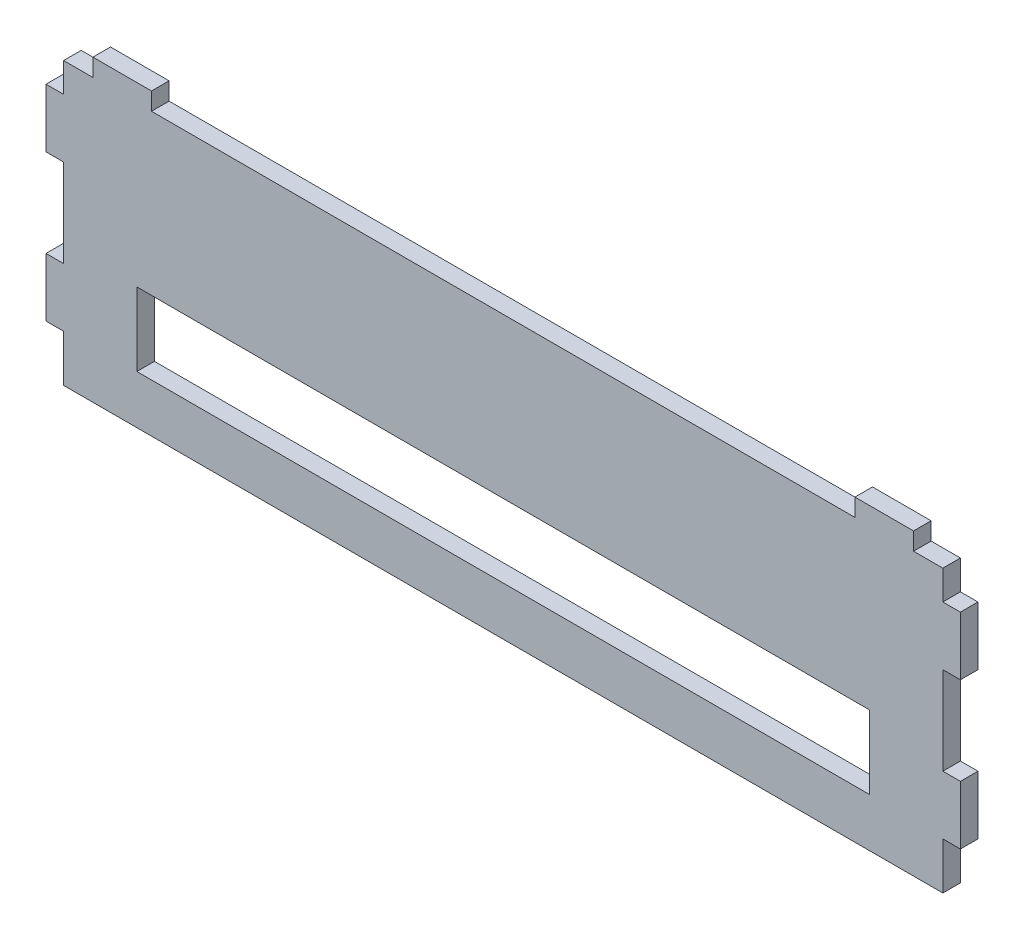
ISO-10303-21;
HEADER;
FILE_DESCRIPTION(('STEP AP214'),'2;1');
FILE_NAME('part.step','',(''),(''),'','','');
FILE_SCHEMA(('AUTOMOTIVE_DESIGN { 1 0 10303 214 1 1 1 1 }'));
ENDSEC;
DATA;
#1=APPLICATION_CONTEXT('core data for automotive mechanical design processes');
#2=APPLICATION_PROTOCOL_DEFINITION('international standard','automotive_design',2000,#1);
#3=PRODUCT_CONTEXT('',#1,'mechanical');
#4=PRODUCT('Part','Part','',(#3));
#5=PRODUCT_RELATED_PRODUCT_CATEGORY('part','',(#4));
#6=PRODUCT_DEFINITION_FORMATION('','',#4);
#7=PRODUCT_DEFINITION_CONTEXT('part definition',#1,'design');
#8=PRODUCT_DEFINITION('design','',#6,#7);
#9=PRODUCT_DEFINITION_SHAPE('','',#8);
#10=(LENGTH_UNIT() NAMED_UNIT(*) SI_UNIT(.MILLI.,.METRE.));
#11=(NAMED_UNIT(*) PLANE_ANGLE_UNIT() SI_UNIT($,.RADIAN.));
#12=(NAMED_UNIT(*) SI_UNIT($,.STERADIAN.) SOLID_ANGLE_UNIT());
#13=UNCERTAINTY_MEASURE_WITH_UNIT(LENGTH_MEASURE(1.E-05),#10,'distance_accuracy_value','');
#14=(GEOMETRIC_REPRESENTATION_CONTEXT(3) GLOBAL_UNCERTAINTY_ASSIGNED_CONTEXT((#13)) GLOBAL_UNIT_ASSIGNED_CONTEXT((#10,
#11,#12)) REPRESENTATION_CONTEXT('',''));
#15=CARTESIAN_POINT('',(0.,0.,0.));
#16=DIRECTION('',(0.,0.,1.));
#17=DIRECTION('',(1.,0.,0.));
#18=AXIS2_PLACEMENT_3D('',#15,#16,#17);
#19=CARTESIAN_POINT('',(495.568859933221,0.,-334.249904798704));
#20=DIRECTION('',(1.,0.,0.));
#21=DIRECTION('',(0.,1.,0.));
#22=AXIS2_PLACEMENT_3D('',#19,#20,#21);
#23=PLANE('',#22);
#24=DIRECTION('',(0.,0.,1.));
#25=VECTOR('',#24,1.);
#26=CARTESIAN_POINT('',(495.568859933221,-9.99999999999979,-334.249904798704));
#27=LINE('',#26,#25);
#28=CARTESIAN_POINT('',(495.568859933221,-9.99999999999979,-6.00000000000006));
#29=VERTEX_POINT('',#28);
#30=CARTESIAN_POINT('',(495.568859933221,-9.99999999999979,0.));
#31=VERTEX_POINT('',#30);
#32=EDGE_CURVE('E271',#29,#31,#27,.T.);
#33=ORIENTED_EDGE('',*,*,#32,.F.);
#34=DIRECTION('',(0.,1.,0.));
#35=VECTOR('',#34,1.);
#36=CARTESIAN_POINT('',(495.568859933221,1.13884563167231E-13,-6.00000000000006));
#37=LINE('',#36,#35);
#38=CARTESIAN_POINT('',(495.568859933221,0.,-6.00000000000006));
#39=VERTEX_POINT('',#38);
#40=EDGE_CURVE('E265',#29,#39,#37,.T.);
#41=ORIENTED_EDGE('',*,*,#40,.T.);
#42=DIRECTION('',(0.,0.,1.));
#43=VECTOR('',#42,1.);
#44=CARTESIAN_POINT('',(495.568859933221,0.,-334.249904798704));
#45=LINE('',#44,#43);
#46=CARTESIAN_POINT('',(495.568859933221,0.,0.));
#47=VERTEX_POINT('',#46);
#48=EDGE_CURVE('E267',#39,#47,#45,.T.);
#49=ORIENTED_EDGE('',*,*,#48,.T.);
#50=DIRECTION('',(0.,1.,0.));
#51=VECTOR('',#50,1.);
#52=CARTESIAN_POINT('',(495.568859933221,0.,0.));
#53=LINE('',#52,#51);
#54=EDGE_CURVE('E413',#31,#47,#53,.T.);
#55=ORIENTED_EDGE('',*,*,#54,.F.);
#56=EDGE_LOOP('',(#33,#41,#49,#55));
#57=FACE_BOUND('',#56,.T.);
#58=ADVANCED_FACE('F33',(#57),#23,.T.);
#59=CARTESIAN_POINT('',(501.568859933221,-9.99999999999979,-334.249904798704));
#60=DIRECTION('',(0.,1.,0.));
#61=DIRECTION('',(0.,0.,1.));
#62=AXIS2_PLACEMENT_3D('',#59,#60,#61);
#63=PLANE('',#62);
#64=DIRECTION('',(0.,0.,1.));
#65=VECTOR('',#64,1.);
#66=CARTESIAN_POINT('',(501.568859933221,-9.99999999999979,-334.249904798704));
#67=LINE('',#66,#65);
#68=CARTESIAN_POINT('',(501.568859933221,-9.99999999999979,-6.00000000000007));
#69=VERTEX_POINT('',#68);
#70=CARTESIAN_POINT('',(501.568859933221,-9.99999999999979,0.));
#71=VERTEX_POINT('',#70);
#72=EDGE_CURVE('E275',#69,#71,#67,.T.);
#73=ORIENTED_EDGE('',*,*,#72,.F.);
#74=DIRECTION('',(-1.,0.,0.));
#75=VECTOR('',#74,1.);
#76=CARTESIAN_POINT('',(501.568859933221,-9.99999999999979,-6.00000000000006));
#77=LINE('',#76,#75);
#78=EDGE_CURVE('E268',#69,#29,#77,.T.);
#79=ORIENTED_EDGE('',*,*,#78,.T.);
#80=ORIENTED_EDGE('',*,*,#32,.T.);
#81=DIRECTION('',(-1.,0.,0.));
#82=VECTOR('',#81,1.);
#83=CARTESIAN_POINT('',(501.568859933221,-9.99999999999979,0.));
#84=LINE('',#83,#82);
#85=EDGE_CURVE('E260',#71,#31,#84,.T.);
#86=ORIENTED_EDGE('',*,*,#85,.F.);
#87=EDGE_LOOP('',(#73,#79,#80,#86));
#88=FACE_BOUND('',#87,.T.);
#89=ADVANCED_FACE('F505',(#88),#63,.T.);
#90=CARTESIAN_POINT('',(501.568859933221,-29.9999999999998,-334.249904798704));
#91=DIRECTION('',(1.,0.,0.));
#92=DIRECTION('',(0.,0.,-1.));
#93=AXIS2_PLACEMENT_3D('',#90,#91,#92);
#94=PLANE('',#93);
#95=DIRECTION('',(0.,0.,1.));
#96=VECTOR('',#95,1.);
#97=CARTESIAN_POINT('',(501.568859933221,-29.9999999999998,-334.249904798704));
#98=LINE('',#97,#96);
#99=CARTESIAN_POINT('',(501.568859933221,-29.9999999999998,-6.00000000000006));
#100=VERTEX_POINT('',#99);
#101=CARTESIAN_POINT('',(501.568859933221,-29.9999999999998,0.));
#102=VERTEX_POINT('',#101);
#103=EDGE_CURVE('E279',#100,#102,#98,.T.);
#104=ORIENTED_EDGE('',*,*,#103,.F.);
#105=DIRECTION('',(0.,1.,0.));
#106=VECTOR('',#105,1.);
#107=CARTESIAN_POINT('',(501.568859933221,-29.9999999999997,-6.00000000000006));
#108=LINE('',#107,#106);
#109=EDGE_CURVE('E272',#100,#69,#108,.T.);
#110=ORIENTED_EDGE('',*,*,#109,.T.);
#111=ORIENTED_EDGE('',*,*,#72,.T.);
#112=DIRECTION('',(0.,1.,0.));
#113=VECTOR('',#112,1.);
#114=CARTESIAN_POINT('',(501.568859933221,-29.9999999999998,0.));
#115=LINE('',#114,#113);
#116=EDGE_CURVE('E497',#102,#71,#115,.T.);
#117=ORIENTED_EDGE('',*,*,#116,.F.);
#118=EDGE_LOOP('',(#104,#110,#111,#117));
#119=FACE_BOUND('',#118,.T.);
#120=ADVANCED_FACE('F609',(#119),#94,.T.);
#121=CARTESIAN_POINT('',(495.568859933221,-29.9999999999998,-334.249904798704));
#122=DIRECTION('',(0.,-1.,0.));
#123=DIRECTION('',(0.,0.,-1.));
#124=AXIS2_PLACEMENT_3D('',#121,#122,#123);
#125=PLANE('',#124);
#126=DIRECTION('',(0.,0.,1.));
#127=VECTOR('',#126,1.);
#128=CARTESIAN_POINT('',(495.568859933221,-29.9999999999998,-334.249904798704));
#129=LINE('',#128,#127);
#130=CARTESIAN_POINT('',(495.568859933221,-29.9999999999998,-6.00000000000006));
#131=VERTEX_POINT('',#130);
#132=CARTESIAN_POINT('',(495.568859933221,-29.9999999999998,0.));
#133=VERTEX_POINT('',#132);
#134=EDGE_CURVE('E283',#131,#133,#129,.T.);
#135=ORIENTED_EDGE('',*,*,#134,.F.);
#136=DIRECTION('',(1.,0.,0.));
#137=VECTOR('',#136,1.);
#138=CARTESIAN_POINT('',(495.568859933221,-29.9999999999998,-6.00000000000006));
#139=LINE('',#138,#137);
#140=EDGE_CURVE('E276',#131,#100,#139,.T.);
#141=ORIENTED_EDGE('',*,*,#140,.T.);
#142=ORIENTED_EDGE('',*,*,#103,.T.);
#143=DIRECTION('',(1.,0.,0.));
#144=VECTOR('',#143,1.);
#145=CARTESIAN_POINT('',(495.568859933221,-29.9999999999998,0.));
#146=LINE('',#145,#144);
#147=EDGE_CURVE('E494',#133,#102,#146,.T.);
#148=ORIENTED_EDGE('',*,*,#147,.F.);
#149=EDGE_LOOP('',(#135,#141,#142,#148));
#150=FACE_BOUND('',#149,.T.);
#151=ADVANCED_FACE('F606',(#150),#125,.T.);
#152=CARTESIAN_POINT('',(495.568859933221,-29.9999999999998,-334.249904798704));
#153=DIRECTION('',(1.,0.,0.));
#154=DIRECTION('',(0.,0.,-1.));
#155=AXIS2_PLACEMENT_3D('',#152,#153,#154);
#156=PLANE('',#155);
#157=DIRECTION('',(0.,0.,1.));
#158=VECTOR('',#157,1.);
#159=CARTESIAN_POINT('',(495.568859933221,-59.9999999999996,-334.249904798704));
#160=LINE('',#159,#158);
#161=CARTESIAN_POINT('',(495.568859933221,-59.9999999999996,-6.00000000000006));
#162=VERTEX_POINT('',#161);
#163=CARTESIAN_POINT('',(495.568859933221,-59.9999999999996,0.));
#164=VERTEX_POINT('',#163);
#165=EDGE_CURVE('E287',#162,#164,#160,.T.);
#166=ORIENTED_EDGE('',*,*,#165,.F.);
#167=DIRECTION('',(0.,1.,0.));
#168=VECTOR('',#167,1.);
#169=CARTESIAN_POINT('',(495.568859933221,-29.9999999999997,-6.00000000000006));
#170=LINE('',#169,#168);
#171=EDGE_CURVE('E280',#162,#131,#170,.T.);
#172=ORIENTED_EDGE('',*,*,#171,.T.);
#173=ORIENTED_EDGE('',*,*,#134,.T.);
#174=DIRECTION('',(0.,1.,0.));
#175=VECTOR('',#174,1.);
#176=CARTESIAN_POINT('',(495.568859933221,-29.9999999999998,0.));
#177=LINE('',#176,#175);
#178=EDGE_CURVE('E491',#164,#133,#177,.T.);
#179=ORIENTED_EDGE('',*,*,#178,.F.);
#180=EDGE_LOOP('',(#166,#172,#173,#179));
#181=FACE_BOUND('',#180,.T.);
#182=ADVANCED_FACE('F603',(#181),#156,.T.);
#183=CARTESIAN_POINT('',(501.568859933221,-59.9999999999996,-334.249904798704));
#184=DIRECTION('',(0.,1.,0.));
#185=DIRECTION('',(0.,0.,1.));
#186=AXIS2_PLACEMENT_3D('',#183,#184,#185);
#187=PLANE('',#186);
#188=DIRECTION('',(0.,0.,1.));
#189=VECTOR('',#188,1.);
#190=CARTESIAN_POINT('',(501.568859933221,-59.9999999999996,-334.249904798704));
#191=LINE('',#190,#189);
#192=CARTESIAN_POINT('',(501.568859933221,-59.9999999999996,-6.00000000000007));
#193=VERTEX_POINT('',#192);
#194=CARTESIAN_POINT('',(501.568859933221,-59.9999999999996,0.));
#195=VERTEX_POINT('',#194);
#196=EDGE_CURVE('E291',#193,#195,#191,.T.);
#197=ORIENTED_EDGE('',*,*,#196,.F.);
#198=DIRECTION('',(-1.,0.,0.));
#199=VECTOR('',#198,1.);
#200=CARTESIAN_POINT('',(501.568859933221,-59.9999999999996,-6.00000000000006));
#201=LINE('',#200,#199);
#202=EDGE_CURVE('E284',#193,#162,#201,.T.);
#203=ORIENTED_EDGE('',*,*,#202,.T.);
#204=ORIENTED_EDGE('',*,*,#165,.T.);
#205=DIRECTION('',(-1.,0.,0.));
#206=VECTOR('',#205,1.);
#207=CARTESIAN_POINT('',(501.568859933221,-59.9999999999996,0.));
#208=LINE('',#207,#206);
#209=EDGE_CURVE('E488',#195,#164,#208,.T.);
#210=ORIENTED_EDGE('',*,*,#209,.F.);
#211=EDGE_LOOP('',(#197,#203,#204,#210));
#212=FACE_BOUND('',#211,.T.);
#213=ADVANCED_FACE('F598',(#212),#187,.T.);
#214=CARTESIAN_POINT('',(501.568859933221,-79.9999999999996,-334.249904798704));
#215=DIRECTION('',(1.,0.,0.));
#216=DIRECTION('',(0.,0.,-1.));
#217=AXIS2_PLACEMENT_3D('',#214,#215,#216);
#218=PLANE('',#217);
#219=DIRECTION('',(0.,0.,1.));
#220=VECTOR('',#219,1.);
#221=CARTESIAN_POINT('',(501.568859933221,-79.9999999999996,-334.249904798704));
#222=LINE('',#221,#220);
#223=CARTESIAN_POINT('',(501.568859933221,-79.9999999999996,-6.00000000000006));
#224=VERTEX_POINT('',#223);
#225=CARTESIAN_POINT('',(501.568859933221,-79.9999999999996,0.));
#226=VERTEX_POINT('',#225);
#227=EDGE_CURVE('E295',#224,#226,#222,.T.);
#228=ORIENTED_EDGE('',*,*,#227,.F.);
#229=DIRECTION('',(0.,1.,0.));
#230=VECTOR('',#229,1.);
#231=CARTESIAN_POINT('',(501.568859933221,-79.9999999999995,-6.00000000000006));
#232=LINE('',#231,#230);
#233=EDGE_CURVE('E288',#224,#193,#232,.T.);
#234=ORIENTED_EDGE('',*,*,#233,.T.);
#235=ORIENTED_EDGE('',*,*,#196,.T.);
#236=DIRECTION('',(0.,1.,0.));
#237=VECTOR('',#236,1.);
#238=CARTESIAN_POINT('',(501.568859933221,-79.9999999999996,0.));
#239=LINE('',#238,#237);
#240=EDGE_CURVE('E485',#226,#195,#239,.T.);
#241=ORIENTED_EDGE('',*,*,#240,.F.);
#242=EDGE_LOOP('',(#228,#234,#235,#241));
#243=FACE_BOUND('',#242,.T.);
#244=ADVANCED_FACE('F594',(#243),#218,.T.);
#245=CARTESIAN_POINT('',(495.568859933221,-79.9999999999996,-334.249904798704));
#246=DIRECTION('',(0.,-1.,0.));
#247=DIRECTION('',(0.,0.,-1.));
#248=AXIS2_PLACEMENT_3D('',#245,#246,#247);
#249=PLANE('',#248);
#250=DIRECTION('',(0.,0.,1.));
#251=VECTOR('',#250,1.);
#252=CARTESIAN_POINT('',(495.568859933221,-79.9999999999996,-334.249904798704));
#253=LINE('',#252,#251);
#254=CARTESIAN_POINT('',(495.568859933221,-79.9999999999996,-6.00000000000006));
#255=VERTEX_POINT('',#254);
#256=CARTESIAN_POINT('',(495.568859933221,-79.9999999999996,0.));
#257=VERTEX_POINT('',#256);
#258=EDGE_CURVE('E299',#255,#257,#253,.T.);
#259=ORIENTED_EDGE('',*,*,#258,.F.);
#260=DIRECTION('',(1.,0.,0.));
#261=VECTOR('',#260,1.);
#262=CARTESIAN_POINT('',(495.568859933221,-79.9999999999996,-6.00000000000006));
#263=LINE('',#262,#261);
#264=EDGE_CURVE('E292',#255,#224,#263,.T.);
#265=ORIENTED_EDGE('',*,*,#264,.T.);
#266=ORIENTED_EDGE('',*,*,#227,.T.);
#267=DIRECTION('',(1.,0.,0.));
#268=VECTOR('',#267,1.);
#269=CARTESIAN_POINT('',(495.568859933221,-79.9999999999996,0.));
#270=LINE('',#269,#268);
#271=EDGE_CURVE('E482',#257,#226,#270,.T.);
#272=ORIENTED_EDGE('',*,*,#271,.F.);
#273=EDGE_LOOP('',(#259,#265,#266,#272));
#274=FACE_BOUND('',#273,.T.);
#275=ADVANCED_FACE('F591',(#274),#249,.T.);
#276=CARTESIAN_POINT('',(495.568859933221,-79.9999999999996,-334.249904798704));
#277=DIRECTION('',(1.,0.,0.));
#278=DIRECTION('',(0.,1.,0.));
#279=AXIS2_PLACEMENT_3D('',#276,#277,#278);
#280=PLANE('',#279);
#281=DIRECTION('',(0.,0.,1.));
#282=VECTOR('',#281,1.);
#283=CARTESIAN_POINT('',(495.568859933221,-96.0000000014325,-334.249904798704));
#284=LINE('',#283,#282);
#285=CARTESIAN_POINT('',(495.568859933221,-96.0000000014325,-6.00000000000006));
#286=VERTEX_POINT('',#285);
#287=CARTESIAN_POINT('',(495.568859933221,-96.0000000014325,0.));
#288=VERTEX_POINT('',#287);
#289=EDGE_CURVE('E303',#286,#288,#284,.T.);
#290=ORIENTED_EDGE('',*,*,#289,.F.);
#291=DIRECTION('',(0.,1.,0.));
#292=VECTOR('',#291,1.);
#293=CARTESIAN_POINT('',(495.568859933221,-79.9999999999995,-6.00000000000006));
#294=LINE('',#293,#292);
#295=EDGE_CURVE('E296',#286,#255,#294,.T.);
#296=ORIENTED_EDGE('',*,*,#295,.T.);
#297=ORIENTED_EDGE('',*,*,#258,.T.);
#298=DIRECTION('',(0.,1.,0.));
#299=VECTOR('',#298,1.);
#300=CARTESIAN_POINT('',(495.568859933221,-79.9999999999996,0.));
#301=LINE('',#300,#299);
#302=EDGE_CURVE('E479',#288,#257,#301,.T.);
#303=ORIENTED_EDGE('',*,*,#302,.F.);
#304=EDGE_LOOP('',(#290,#296,#297,#303));
#305=FACE_BOUND('',#304,.T.);
#306=ADVANCED_FACE('F586',(#305),#280,.T.);
#307=CARTESIAN_POINT('',(495.568859933221,-96.0000000014325,-334.249904798704));
#308=DIRECTION('',(0.,-1.,0.));
#309=DIRECTION('',(0.,0.,-1.));
#310=AXIS2_PLACEMENT_3D('',#307,#308,#309);
#311=PLANE('',#310);
#312=DIRECTION('',(0.,0.,1.));
#313=VECTOR('',#312,1.);
#314=CARTESIAN_POINT('',(195.568859933244,-96.0000000014325,-334.249904798704));
#315=LINE('',#314,#313);
#316=CARTESIAN_POINT('',(195.568859933244,-96.0000000014325,-6.00000000000011));
#317=VERTEX_POINT('',#316);
#318=CARTESIAN_POINT('',(195.568859933244,-96.0000000014325,0.));
#319=VERTEX_POINT('',#318);
#320=EDGE_CURVE('E307',#317,#319,#315,.T.);
#321=ORIENTED_EDGE('',*,*,#320,.F.);
#322=DIRECTION('',(1.,0.,0.));
#323=VECTOR('',#322,1.);
#324=CARTESIAN_POINT('',(495.568859933221,-96.0000000014325,-6.00000000000006));
#325=LINE('',#324,#323);
#326=EDGE_CURVE('E300',#317,#286,#325,.T.);
#327=ORIENTED_EDGE('',*,*,#326,.T.);
#328=ORIENTED_EDGE('',*,*,#289,.T.);
#329=DIRECTION('',(1.,0.,0.));
#330=VECTOR('',#329,1.);
#331=CARTESIAN_POINT('',(495.568859933221,-96.0000000014325,0.));
#332=LINE('',#331,#330);
#333=EDGE_CURVE('E476',#319,#288,#332,.T.);
#334=ORIENTED_EDGE('',*,*,#333,.F.);
#335=EDGE_LOOP('',(#321,#327,#328,#334));
#336=FACE_BOUND('',#335,.T.);
#337=ADVANCED_FACE('F582',(#336),#311,.T.);
#338=CARTESIAN_POINT('',(195.568859933245,-80.0000000014323,-334.249904798704));
#339=DIRECTION('',(-1.,0.,0.));
#340=DIRECTION('',(0.,-1.,0.));
#341=AXIS2_PLACEMENT_3D('',#338,#339,#340);
#342=PLANE('',#341);
#343=DIRECTION('',(0.,0.,1.));
#344=VECTOR('',#343,1.);
#345=CARTESIAN_POINT('',(195.568859933245,-80.0000000014323,-334.249904798704));
#346=LINE('',#345,#344);
#347=CARTESIAN_POINT('',(195.568859933245,-80.0000000014323,-6.00000000000011));
#348=VERTEX_POINT('',#347);
#349=CARTESIAN_POINT('',(195.568859933245,-80.0000000014323,0.));
#350=VERTEX_POINT('',#349);
#351=EDGE_CURVE('E311',#348,#350,#346,.T.);
#352=ORIENTED_EDGE('',*,*,#351,.F.);
#353=DIRECTION('',(0.,-1.,0.));
#354=VECTOR('',#353,1.);
#355=CARTESIAN_POINT('',(195.568859933245,-80.0000000014321,-6.00000000000012));
#356=LINE('',#355,#354);
#357=EDGE_CURVE('E304',#348,#317,#356,.T.);
#358=ORIENTED_EDGE('',*,*,#357,.T.);
#359=ORIENTED_EDGE('',*,*,#320,.T.);
#360=DIRECTION('',(0.,-1.,0.));
#361=VECTOR('',#360,1.);
#362=CARTESIAN_POINT('',(195.568859933245,-80.0000000014323,0.));
#363=LINE('',#362,#361);
#364=EDGE_CURVE('E473',#350,#319,#363,.T.);
#365=ORIENTED_EDGE('',*,*,#364,.F.);
#366=EDGE_LOOP('',(#352,#358,#359,#365));
#367=FACE_BOUND('',#366,.T.);
#368=ADVANCED_FACE('F579',(#367),#342,.T.);
#369=CARTESIAN_POINT('',(189.568859933245,-80.0000000014323,-334.249904798704));
#370=DIRECTION('',(0.,-1.,0.));
#371=DIRECTION('',(0.,0.,-1.));
#372=AXIS2_PLACEMENT_3D('',#369,#370,#371);
#373=PLANE('',#372);
#374=DIRECTION('',(0.,0.,1.));
#375=VECTOR('',#374,1.);
#376=CARTESIAN_POINT('',(189.568859933245,-80.0000000014323,-334.249904798704));
#377=LINE('',#376,#375);
#378=CARTESIAN_POINT('',(189.568859933245,-80.0000000014323,-6.00000000000017));
#379=VERTEX_POINT('',#378);
#380=CARTESIAN_POINT('',(189.568859933245,-80.0000000014323,0.));
#381=VERTEX_POINT('',#380);
#382=EDGE_CURVE('E315',#379,#381,#377,.T.);
#383=ORIENTED_EDGE('',*,*,#382,.F.);
#384=DIRECTION('',(1.,0.,0.));
#385=VECTOR('',#384,1.);
#386=CARTESIAN_POINT('',(189.568859933245,-80.0000000014323,-6.00000000000012));
#387=LINE('',#386,#385);
#388=EDGE_CURVE('E308',#379,#348,#387,.T.);
#389=ORIENTED_EDGE('',*,*,#388,.T.);
#390=ORIENTED_EDGE('',*,*,#351,.T.);
#391=DIRECTION('',(1.,0.,0.));
#392=VECTOR('',#391,1.);
#393=CARTESIAN_POINT('',(189.568859933245,-80.0000000014323,0.));
#394=LINE('',#393,#392);
#395=EDGE_CURVE('E470',#381,#350,#394,.T.);
#396=ORIENTED_EDGE('',*,*,#395,.F.);
#397=EDGE_LOOP('',(#383,#389,#390,#396));
#398=FACE_BOUND('',#397,.T.);
#399=ADVANCED_FACE('F574',(#398),#373,.T.);
#400=CARTESIAN_POINT('',(189.568859933245,-60.0000000014322,-334.249904798704));
#401=DIRECTION('',(-1.,0.,0.));
#402=DIRECTION('',(0.,0.,1.));
#403=AXIS2_PLACEMENT_3D('',#400,#401,#402);
#404=PLANE('',#403);
#405=DIRECTION('',(0.,0.,1.));
#406=VECTOR('',#405,1.);
#407=CARTESIAN_POINT('',(189.568859933245,-60.0000000014322,-334.249904798704));
#408=LINE('',#407,#406);
#409=CARTESIAN_POINT('',(189.568859933245,-60.0000000014322,-6.00000000000017));
#410=VERTEX_POINT('',#409);
#411=CARTESIAN_POINT('',(189.568859933245,-60.0000000014322,0.));
#412=VERTEX_POINT('',#411);
#413=EDGE_CURVE('E319',#410,#412,#408,.T.);
#414=ORIENTED_EDGE('',*,*,#413,.F.);
#415=DIRECTION('',(0.,-1.,0.));
#416=VECTOR('',#415,1.);
#417=CARTESIAN_POINT('',(189.568859933245,-60.0000000014321,-6.00000000000017));
#418=LINE('',#417,#416);
#419=EDGE_CURVE('E312',#410,#379,#418,.T.);
#420=ORIENTED_EDGE('',*,*,#419,.T.);
#421=ORIENTED_EDGE('',*,*,#382,.T.);
#422=DIRECTION('',(0.,-1.,0.));
#423=VECTOR('',#422,1.);
#424=CARTESIAN_POINT('',(189.568859933245,-60.0000000014322,0.));
#425=LINE('',#424,#423);
#426=EDGE_CURVE('E467',#412,#381,#425,.T.);
#427=ORIENTED_EDGE('',*,*,#426,.F.);
#428=EDGE_LOOP('',(#414,#420,#421,#427));
#429=FACE_BOUND('',#428,.T.);
#430=ADVANCED_FACE('F570',(#429),#404,.T.);
#431=CARTESIAN_POINT('',(195.568859933245,-60.0000000014322,-334.249904798704));
#432=DIRECTION('',(0.,1.,0.));
#433=DIRECTION('',(0.,0.,1.));
#434=AXIS2_PLACEMENT_3D('',#431,#432,#433);
#435=PLANE('',#434);
#436=DIRECTION('',(0.,0.,1.));
#437=VECTOR('',#436,1.);
#438=CARTESIAN_POINT('',(195.568859933245,-60.0000000014322,-334.249904798704));
#439=LINE('',#438,#437);
#440=CARTESIAN_POINT('',(195.568859933245,-60.0000000014322,-6.00000000000016));
#441=VERTEX_POINT('',#440);
#442=CARTESIAN_POINT('',(195.568859933245,-60.0000000014322,0.));
#443=VERTEX_POINT('',#442);
#444=EDGE_CURVE('E323',#441,#443,#439,.T.);
#445=ORIENTED_EDGE('',*,*,#444,.F.);
#446=DIRECTION('',(-1.,0.,0.));
#447=VECTOR('',#446,1.);
#448=CARTESIAN_POINT('',(195.568859933245,-60.0000000014322,-6.00000000000017));
#449=LINE('',#448,#447);
#450=EDGE_CURVE('E316',#441,#410,#449,.T.);
#451=ORIENTED_EDGE('',*,*,#450,.T.);
#452=ORIENTED_EDGE('',*,*,#413,.T.);
#453=DIRECTION('',(-1.,0.,0.));
#454=VECTOR('',#453,1.);
#455=CARTESIAN_POINT('',(195.568859933245,-60.0000000014322,0.));
#456=LINE('',#455,#454);
#457=EDGE_CURVE('E464',#443,#412,#456,.T.);
#458=ORIENTED_EDGE('',*,*,#457,.F.);
#459=EDGE_LOOP('',(#445,#451,#452,#458));
#460=FACE_BOUND('',#459,.T.);
#461=ADVANCED_FACE('F567',(#460),#435,.T.);
#462=CARTESIAN_POINT('',(195.568859933245,-30.0000000014324,-334.249904798704));
#463=DIRECTION('',(-1.,0.,0.));
#464=DIRECTION('',(0.,0.,1.));
#465=AXIS2_PLACEMENT_3D('',#462,#463,#464);
#466=PLANE('',#465);
#467=DIRECTION('',(0.,0.,1.));
#468=VECTOR('',#467,1.);
#469=CARTESIAN_POINT('',(195.568859933245,-30.0000000014324,-334.249904798704));
#470=LINE('',#469,#468);
#471=CARTESIAN_POINT('',(195.568859933245,-30.0000000014324,-6.00000000000017));
#472=VERTEX_POINT('',#471);
#473=CARTESIAN_POINT('',(195.568859933245,-30.0000000014324,0.));
#474=VERTEX_POINT('',#473);
#475=EDGE_CURVE('E327',#472,#474,#470,.T.);
#476=ORIENTED_EDGE('',*,*,#475,.F.);
#477=DIRECTION('',(0.,-1.,0.));
#478=VECTOR('',#477,1.);
#479=CARTESIAN_POINT('',(195.568859933245,-30.0000000014323,-6.00000000000017));
#480=LINE('',#479,#478);
#481=EDGE_CURVE('E320',#472,#441,#480,.T.);
#482=ORIENTED_EDGE('',*,*,#481,.T.);
#483=ORIENTED_EDGE('',*,*,#444,.T.);
#484=DIRECTION('',(0.,-1.,0.));
#485=VECTOR('',#484,1.);
#486=CARTESIAN_POINT('',(195.568859933245,-30.0000000014324,0.));
#487=LINE('',#486,#485);
#488=EDGE_CURVE('E461',#474,#443,#487,.T.);
#489=ORIENTED_EDGE('',*,*,#488,.F.);
#490=EDGE_LOOP('',(#476,#482,#483,#489));
#491=FACE_BOUND('',#490,.T.);
#492=ADVANCED_FACE('F562',(#491),#466,.T.);
#493=CARTESIAN_POINT('',(189.568859933245,-30.0000000014324,-334.249904798704));
#494=DIRECTION('',(0.,-1.,0.));
#495=DIRECTION('',(0.,0.,-1.));
#496=AXIS2_PLACEMENT_3D('',#493,#494,#495);
#497=PLANE('',#496);
#498=DIRECTION('',(0.,0.,1.));
#499=VECTOR('',#498,1.);
#500=CARTESIAN_POINT('',(189.568859933245,-30.0000000014324,-334.249904798704));
#501=LINE('',#500,#499);
#502=CARTESIAN_POINT('',(189.568859933245,-30.0000000014324,-6.00000000000017));
#503=VERTEX_POINT('',#502);
#504=CARTESIAN_POINT('',(189.568859933245,-30.0000000014324,0.));
#505=VERTEX_POINT('',#504);
#506=EDGE_CURVE('E331',#503,#505,#501,.T.);
#507=ORIENTED_EDGE('',*,*,#506,.F.);
#508=DIRECTION('',(1.,0.,0.));
#509=VECTOR('',#508,1.);
#510=CARTESIAN_POINT('',(189.568859933245,-30.0000000014324,-6.00000000000017));
#511=LINE('',#510,#509);
#512=EDGE_CURVE('E324',#503,#472,#511,.T.);
#513=ORIENTED_EDGE('',*,*,#512,.T.);
#514=ORIENTED_EDGE('',*,*,#475,.T.);
#515=DIRECTION('',(1.,0.,0.));
#516=VECTOR('',#515,1.);
#517=CARTESIAN_POINT('',(189.568859933245,-30.0000000014324,0.));
#518=LINE('',#517,#516);
#519=EDGE_CURVE('E458',#505,#474,#518,.T.);
#520=ORIENTED_EDGE('',*,*,#519,.F.);
#521=EDGE_LOOP('',(#507,#513,#514,#520));
#522=FACE_BOUND('',#521,.T.);
#523=ADVANCED_FACE('F558',(#522),#497,.T.);
#524=CARTESIAN_POINT('',(189.568859933245,-10.0000000014324,-334.249904798704));
#525=DIRECTION('',(-1.,0.,0.));
#526=DIRECTION('',(0.,-1.,0.));
#527=AXIS2_PLACEMENT_3D('',#524,#525,#526);
#528=PLANE('',#527);
#529=DIRECTION('',(0.,0.,1.));
#530=VECTOR('',#529,1.);
#531=CARTESIAN_POINT('',(189.568859933245,-10.0000000014324,-334.249904798704));
#532=LINE('',#531,#530);
#533=CARTESIAN_POINT('',(189.568859933245,-10.0000000014324,-6.00000000000017));
#534=VERTEX_POINT('',#533);
#535=CARTESIAN_POINT('',(189.568859933245,-10.0000000014324,0.));
#536=VERTEX_POINT('',#535);
#537=EDGE_CURVE('E335',#534,#536,#532,.T.);
#538=ORIENTED_EDGE('',*,*,#537,.F.);
#539=DIRECTION('',(0.,-1.,0.));
#540=VECTOR('',#539,1.);
#541=CARTESIAN_POINT('',(189.568859933245,-10.0000000014323,-6.00000000000017));
#542=LINE('',#541,#540);
#543=EDGE_CURVE('E328',#534,#503,#542,.T.);
#544=ORIENTED_EDGE('',*,*,#543,.T.);
#545=ORIENTED_EDGE('',*,*,#506,.T.);
#546=DIRECTION('',(0.,-1.,0.));
#547=VECTOR('',#546,1.);
#548=CARTESIAN_POINT('',(189.568859933245,-10.0000000014324,0.));
#549=LINE('',#548,#547);
#550=EDGE_CURVE('E455',#536,#505,#549,.T.);
#551=ORIENTED_EDGE('',*,*,#550,.F.);
#552=EDGE_LOOP('',(#538,#544,#545,#551));
#553=FACE_BOUND('',#552,.T.);
#554=ADVANCED_FACE('F555',(#553),#528,.T.);
#555=CARTESIAN_POINT('',(195.568859933245,-10.0000000014324,-334.249904798704));
#556=DIRECTION('',(0.,1.,0.));
#557=DIRECTION('',(0.,0.,1.));
#558=AXIS2_PLACEMENT_3D('',#555,#556,#557);
#559=PLANE('',#558);
#560=DIRECTION('',(0.,0.,1.));
#561=VECTOR('',#560,1.);
#562=CARTESIAN_POINT('',(195.568859933245,-10.0000000014324,-334.249904798704));
#563=LINE('',#562,#561);
#564=CARTESIAN_POINT('',(195.568859933245,-10.0000000014324,-6.00000000000017));
#565=VERTEX_POINT('',#564);
#566=CARTESIAN_POINT('',(195.568859933245,-10.0000000014324,0.));
#567=VERTEX_POINT('',#566);
#568=EDGE_CURVE('E339',#565,#567,#563,.T.);
#569=ORIENTED_EDGE('',*,*,#568,.F.);
#570=DIRECTION('',(-1.,0.,0.));
#571=VECTOR('',#570,1.);
#572=CARTESIAN_POINT('',(195.568859933245,-10.0000000014324,-6.00000000000017));
#573=LINE('',#572,#571);
#574=EDGE_CURVE('E332',#565,#534,#573,.T.);
#575=ORIENTED_EDGE('',*,*,#574,.T.);
#576=ORIENTED_EDGE('',*,*,#537,.T.);
#577=DIRECTION('',(-1.,0.,0.));
#578=VECTOR('',#577,1.);
#579=CARTESIAN_POINT('',(195.568859933245,-10.0000000014324,0.));
#580=LINE('',#579,#578);
#581=EDGE_CURVE('E452',#567,#536,#580,.T.);
#582=ORIENTED_EDGE('',*,*,#581,.F.);
#583=EDGE_LOOP('',(#569,#575,#576,#582));
#584=FACE_BOUND('',#583,.T.);
#585=ADVANCED_FACE('F550',(#584),#559,.T.);
#586=CARTESIAN_POINT('',(195.568859933246,0.,-334.249904798704));
#587=DIRECTION('',(-1.,1.3045120537477E-13,0.));
#588=DIRECTION('',(-1.3045120537477E-13,-1.,0.));
#589=AXIS2_PLACEMENT_3D('',#586,#587,#588);
#590=PLANE('',#589);
#591=DIRECTION('',(0.,0.,1.));
#592=VECTOR('',#591,1.);
#593=CARTESIAN_POINT('',(195.568859933246,0.,-334.249904798704));
#594=LINE('',#593,#592);
#595=CARTESIAN_POINT('',(195.568859933246,0.,-6.00000000000017));
#596=VERTEX_POINT('',#595);
#597=CARTESIAN_POINT('',(195.568859933246,0.,0.));
#598=VERTEX_POINT('',#597);
#599=EDGE_CURVE('E343',#596,#598,#594,.T.);
#600=ORIENTED_EDGE('',*,*,#599,.F.);
#601=DIRECTION('',(-1.3045120537477E-13,-1.,0.));
#602=VECTOR('',#601,1.);
#603=CARTESIAN_POINT('',(195.568859933246,1.13884563167218E-13,-6.00000000000017));
#604=LINE('',#603,#602);
#605=EDGE_CURVE('E336',#596,#565,#604,.T.);
#606=ORIENTED_EDGE('',*,*,#605,.T.);
#607=ORIENTED_EDGE('',*,*,#568,.T.);
#608=DIRECTION('',(-1.3045120537477E-13,-1.,0.));
#609=VECTOR('',#608,1.);
#610=CARTESIAN_POINT('',(195.568859933246,0.,0.));
#611=LINE('',#610,#609);
#612=EDGE_CURVE('E449',#598,#567,#611,.T.);
#613=ORIENTED_EDGE('',*,*,#612,.F.);
#614=EDGE_LOOP('',(#600,#606,#607,#613));
#615=FACE_BOUND('',#614,.T.);
#616=ADVANCED_FACE('F546',(#615),#590,.T.);
#617=CARTESIAN_POINT('',(205.56885993325,3.96362630217251E-10,-334.249904798704));
#618=DIRECTION('',(-3.96362630217089E-11,1.,0.));
#619=DIRECTION('',(-1.,-3.96362630217089E-11,0.));
#620=AXIS2_PLACEMENT_3D('',#617,#618,#619);
#621=PLANE('',#620);
#622=DIRECTION('',(0.,0.,1.));
#623=VECTOR('',#622,1.);
#624=CARTESIAN_POINT('',(205.56885993325,3.96362630217251E-10,-334.249904798704));
#625=LINE('',#624,#623);
#626=CARTESIAN_POINT('',(205.56885993325,3.96362630217251E-10,-6.00000000000017));
#627=VERTEX_POINT('',#626);
#628=CARTESIAN_POINT('',(205.56885993325,3.96362630217251E-10,0.));
#629=VERTEX_POINT('',#628);
#630=EDGE_CURVE('E347',#627,#629,#625,.T.);
#631=ORIENTED_EDGE('',*,*,#630,.F.);
#632=DIRECTION('',(-1.,-3.96362630217089E-11,0.));
#633=VECTOR('',#632,1.);
#634=CARTESIAN_POINT('',(205.56885993325,3.96362630217247E-10,-6.00000000000017));
#635=LINE('',#634,#633);
#636=EDGE_CURVE('E340',#627,#596,#635,.T.);
#637=ORIENTED_EDGE('',*,*,#636,.T.);
#638=ORIENTED_EDGE('',*,*,#599,.T.);
#639=DIRECTION('',(-1.,-3.96362630217089E-11,0.));
#640=VECTOR('',#639,1.);
#641=CARTESIAN_POINT('',(205.56885993325,3.96362630217251E-10,0.));
#642=LINE('',#641,#640);
#643=EDGE_CURVE('E446',#629,#598,#642,.T.);
#644=ORIENTED_EDGE('',*,*,#643,.F.);
#645=EDGE_LOOP('',(#631,#637,#638,#644));
#646=FACE_BOUND('',#645,.T.);
#647=ADVANCED_FACE('F543',(#646),#621,.T.);
#648=CARTESIAN_POINT('',(205.56885993325,6.00000000039636,-334.249904798704));
#649=DIRECTION('',(-1.,0.,0.));
#650=DIRECTION('',(0.,0.,1.));
#651=AXIS2_PLACEMENT_3D('',#648,#649,#650);
#652=PLANE('',#651);
#653=DIRECTION('',(0.,0.,1.));
#654=VECTOR('',#653,1.);
#655=CARTESIAN_POINT('',(205.56885993325,6.00000000039636,-334.249904798704));
#656=LINE('',#655,#654);
#657=CARTESIAN_POINT('',(205.56885993325,6.00000000039636,-6.00000000000018));
#658=VERTEX_POINT('',#657);
#659=CARTESIAN_POINT('',(205.56885993325,6.00000000039636,0.));
#660=VERTEX_POINT('',#659);
#661=EDGE_CURVE('E351',#658,#660,#656,.T.);
#662=ORIENTED_EDGE('',*,*,#661,.F.);
#663=DIRECTION('',(0.,-1.,0.));
#664=VECTOR('',#663,1.);
#665=CARTESIAN_POINT('',(205.56885993325,6.00000000039648,-6.00000000000017));
#666=LINE('',#665,#664);
#667=EDGE_CURVE('E344',#658,#627,#666,.T.);
#668=ORIENTED_EDGE('',*,*,#667,.T.);
#669=ORIENTED_EDGE('',*,*,#630,.T.);
#670=DIRECTION('',(0.,-1.,0.));
#671=VECTOR('',#670,1.);
#672=CARTESIAN_POINT('',(205.56885993325,6.00000000039636,0.));
#673=LINE('',#672,#671);
#674=EDGE_CURVE('E443',#660,#629,#673,.T.);
#675=ORIENTED_EDGE('',*,*,#674,.F.);
#676=EDGE_LOOP('',(#662,#668,#669,#675));
#677=FACE_BOUND('',#676,.T.);
#678=ADVANCED_FACE('F538',(#677),#652,.T.);
#679=CARTESIAN_POINT('',(225.56885993325,6.00000000039636,-334.249904798704));
#680=DIRECTION('',(0.,1.,0.));
#681=DIRECTION('',(-1.,0.,0.));
#682=AXIS2_PLACEMENT_3D('',#679,#680,#681);
#683=PLANE('',#682);
#684=DIRECTION('',(0.,0.,1.));
#685=VECTOR('',#684,1.);
#686=CARTESIAN_POINT('',(225.56885993325,6.00000000039636,-334.249904798704));
#687=LINE('',#686,#685);
#688=CARTESIAN_POINT('',(225.56885993325,6.00000000039636,-6.00000000000017));
#689=VERTEX_POINT('',#688);
#690=CARTESIAN_POINT('',(225.56885993325,6.00000000039636,0.));
#691=VERTEX_POINT('',#690);
#692=EDGE_CURVE('E355',#689,#691,#687,.T.);
#693=ORIENTED_EDGE('',*,*,#692,.F.);
#694=DIRECTION('',(-1.,0.,0.));
#695=VECTOR('',#694,1.);
#696=CARTESIAN_POINT('',(225.56885993325,6.00000000039636,-6.00000000000017));
#697=LINE('',#696,#695);
#698=EDGE_CURVE('E348',#689,#658,#697,.T.);
#699=ORIENTED_EDGE('',*,*,#698,.T.);
#700=ORIENTED_EDGE('',*,*,#661,.T.);
#701=DIRECTION('',(-1.,0.,0.));
#702=VECTOR('',#701,1.);
#703=CARTESIAN_POINT('',(225.56885993325,6.00000000039636,0.));
#704=LINE('',#703,#702);
#705=EDGE_CURVE('E440',#691,#660,#704,.T.);
#706=ORIENTED_EDGE('',*,*,#705,.F.);
#707=EDGE_LOOP('',(#693,#699,#700,#706));
#708=FACE_BOUND('',#707,.T.);
#709=ADVANCED_FACE('F534',(#708),#683,.T.);
#710=CARTESIAN_POINT('',(225.56885993325,3.96360028132037E-10,-334.249904798704));
#711=DIRECTION('',(1.,0.,0.));
#712=DIRECTION('',(0.,0.,-1.));
#713=AXIS2_PLACEMENT_3D('',#710,#711,#712);
#714=PLANE('',#713);
#715=DIRECTION('',(0.,0.,1.));
#716=VECTOR('',#715,1.);
#717=CARTESIAN_POINT('',(225.56885993325,3.96360028132037E-10,-334.249904798704));
#718=LINE('',#717,#716);
#719=CARTESIAN_POINT('',(225.56885993325,3.96360028132037E-10,-6.00000000000014));
#720=VERTEX_POINT('',#719);
#721=CARTESIAN_POINT('',(225.56885993325,3.96360028132037E-10,0.));
#722=VERTEX_POINT('',#721);
#723=EDGE_CURVE('E359',#720,#722,#718,.T.);
#724=ORIENTED_EDGE('',*,*,#723,.F.);
#725=DIRECTION('',(0.,1.,0.));
#726=VECTOR('',#725,1.);
#727=CARTESIAN_POINT('',(225.56885993325,3.96473912695204E-10,-6.00000000000017));
#728=LINE('',#727,#726);
#729=EDGE_CURVE('E352',#720,#689,#728,.T.);
#730=ORIENTED_EDGE('',*,*,#729,.T.);
#731=ORIENTED_EDGE('',*,*,#692,.T.);
#732=DIRECTION('',(0.,1.,0.));
#733=VECTOR('',#732,1.);
#734=CARTESIAN_POINT('',(225.56885993325,3.96360028132037E-10,0.));
#735=LINE('',#734,#733);
#736=EDGE_CURVE('E437',#722,#691,#735,.T.);
#737=ORIENTED_EDGE('',*,*,#736,.F.);
#738=EDGE_LOOP('',(#724,#730,#731,#737));
#739=FACE_BOUND('',#738,.T.);
#740=ADVANCED_FACE('F531',(#739),#714,.T.);
#741=CARTESIAN_POINT('',(465.568859933221,0.,-334.249904798704));
#742=DIRECTION('',(1.65150011721702E-12,1.,0.));
#743=DIRECTION('',(-1.,1.65150011721702E-12,0.));
#744=AXIS2_PLACEMENT_3D('',#741,#742,#743);
#745=PLANE('',#744);
#746=DIRECTION('',(0.,0.,1.));
#747=VECTOR('',#746,1.);
#748=CARTESIAN_POINT('',(465.568859933221,0.,-334.249904798704));
#749=LINE('',#748,#747);
#750=CARTESIAN_POINT('',(465.568859933221,0.,-6.00000000000006));
#751=VERTEX_POINT('',#750);
#752=CARTESIAN_POINT('',(465.568859933221,0.,0.));
#753=VERTEX_POINT('',#752);
#754=EDGE_CURVE('E363',#751,#753,#749,.T.);
#755=ORIENTED_EDGE('',*,*,#754,.F.);
#756=DIRECTION('',(-1.,1.65150011721702E-12,0.));
#757=VECTOR('',#756,1.);
#758=CARTESIAN_POINT('',(465.568859933221,0.,-6.00000000000006));
#759=LINE('',#758,#757);
#760=EDGE_CURVE('E356',#751,#720,#759,.T.);
#761=ORIENTED_EDGE('',*,*,#760,.T.);
#762=ORIENTED_EDGE('',*,*,#723,.T.);
#763=DIRECTION('',(-1.,1.65150011721702E-12,0.));
#764=VECTOR('',#763,1.);
#765=CARTESIAN_POINT('',(465.568859933221,0.,0.));
#766=LINE('',#765,#764);
#767=EDGE_CURVE('E434',#753,#722,#766,.T.);
#768=ORIENTED_EDGE('',*,*,#767,.F.);
#769=EDGE_LOOP('',(#755,#761,#762,#768));
#770=FACE_BOUND('',#769,.T.);
#771=ADVANCED_FACE('F526',(#770),#745,.T.);
#772=CARTESIAN_POINT('',(465.568859933221,6.,-334.249904798704));
#773=DIRECTION('',(-1.,0.,0.));
#774=DIRECTION('',(0.,0.,1.));
#775=AXIS2_PLACEMENT_3D('',#772,#773,#774);
#776=PLANE('',#775);
#777=DIRECTION('',(0.,0.,1.));
#778=VECTOR('',#777,1.);
#779=CARTESIAN_POINT('',(465.568859933221,6.,-334.249904798704));
#780=LINE('',#779,#778);
#781=CARTESIAN_POINT('',(465.568859933221,6.,-6.00000000000007));
#782=VERTEX_POINT('',#781);
#783=CARTESIAN_POINT('',(465.568859933221,6.,0.));
#784=VERTEX_POINT('',#783);
#785=EDGE_CURVE('E367',#782,#784,#780,.T.);
#786=ORIENTED_EDGE('',*,*,#785,.F.);
#787=DIRECTION('',(0.,-1.,0.));
#788=VECTOR('',#787,1.);
#789=CARTESIAN_POINT('',(465.568859933221,6.00000000000011,-6.00000000000006));
#790=LINE('',#789,#788);
#791=EDGE_CURVE('E360',#782,#751,#790,.T.);
#792=ORIENTED_EDGE('',*,*,#791,.T.);
#793=ORIENTED_EDGE('',*,*,#754,.T.);
#794=DIRECTION('',(0.,-1.,0.));
#795=VECTOR('',#794,1.);
#796=CARTESIAN_POINT('',(465.568859933221,6.,0.));
#797=LINE('',#796,#795);
#798=EDGE_CURVE('E431',#784,#753,#797,.T.);
#799=ORIENTED_EDGE('',*,*,#798,.F.);
#800=EDGE_LOOP('',(#786,#792,#793,#799));
#801=FACE_BOUND('',#800,.T.);
#802=ADVANCED_FACE('F522',(#801),#776,.T.);
#803=CARTESIAN_POINT('',(485.568859933221,6.,-334.249904798704));
#804=DIRECTION('',(0.,1.,0.));
#805=DIRECTION('',(0.,0.,1.));
#806=AXIS2_PLACEMENT_3D('',#803,#804,#805);
#807=PLANE('',#806);
#808=DIRECTION('',(0.,0.,1.));
#809=VECTOR('',#808,1.);
#810=CARTESIAN_POINT('',(485.568859933221,6.,-334.249904798704));
#811=LINE('',#810,#809);
#812=CARTESIAN_POINT('',(485.568859933221,6.,-6.00000000000006));
#813=VERTEX_POINT('',#812);
#814=CARTESIAN_POINT('',(485.568859933221,6.,0.));
#815=VERTEX_POINT('',#814);
#816=EDGE_CURVE('E370',#813,#815,#811,.T.);
#817=ORIENTED_EDGE('',*,*,#816,.F.);
#818=DIRECTION('',(-1.,0.,0.));
#819=VECTOR('',#818,1.);
#820=CARTESIAN_POINT('',(485.568859933221,6.,-6.00000000000006));
#821=LINE('',#820,#819);
#822=EDGE_CURVE('E364',#813,#782,#821,.T.);
#823=ORIENTED_EDGE('',*,*,#822,.T.);
#824=ORIENTED_EDGE('',*,*,#785,.T.);
#825=DIRECTION('',(-1.,0.,0.));
#826=VECTOR('',#825,1.);
#827=CARTESIAN_POINT('',(485.568859933221,6.,0.));
#828=LINE('',#827,#826);
#829=EDGE_CURVE('E426',#815,#784,#828,.T.);
#830=ORIENTED_EDGE('',*,*,#829,.F.);
#831=EDGE_LOOP('',(#817,#823,#824,#830));
#832=FACE_BOUND('',#831,.T.);
#833=ADVANCED_FACE('F519',(#832),#807,.T.);
#834=CARTESIAN_POINT('',(485.568859933221,0.,-334.249904798704));
#835=DIRECTION('',(1.,0.,0.));
#836=DIRECTION('',(0.,0.,-1.));
#837=AXIS2_PLACEMENT_3D('',#834,#835,#836);
#838=PLANE('',#837);
#839=DIRECTION('',(0.,0.,1.));
#840=VECTOR('',#839,1.);
#841=CARTESIAN_POINT('',(485.568859933221,0.,-334.249904798704));
#842=LINE('',#841,#840);
#843=CARTESIAN_POINT('',(485.568859933221,0.,-6.00000000000006));
#844=VERTEX_POINT('',#843);
#845=CARTESIAN_POINT('',(485.568859933221,0.,0.));
#846=VERTEX_POINT('',#845);
#847=EDGE_CURVE('E398',#844,#846,#842,.T.);
#848=ORIENTED_EDGE('',*,*,#847,.F.);
#849=DIRECTION('',(0.,1.,0.));
#850=VECTOR('',#849,1.);
#851=CARTESIAN_POINT('',(485.568859933221,1.13884563167232E-13,-6.00000000000006));
#852=LINE('',#851,#850);
#853=EDGE_CURVE('E368',#844,#813,#852,.T.);
#854=ORIENTED_EDGE('',*,*,#853,.T.);
#855=ORIENTED_EDGE('',*,*,#816,.T.);
#856=DIRECTION('',(0.,1.,0.));
#857=VECTOR('',#856,1.);
#858=CARTESIAN_POINT('',(485.568859933221,0.,0.));
#859=LINE('',#858,#857);
#860=EDGE_CURVE('E423',#846,#815,#859,.T.);
#861=ORIENTED_EDGE('',*,*,#860,.F.);
#862=EDGE_LOOP('',(#848,#854,#855,#861));
#863=FACE_BOUND('',#862,.T.);
#864=ADVANCED_FACE('F514',(#863),#838,.T.);
#865=CARTESIAN_POINT('',(495.568859933221,0.,-334.249904798704));
#866=DIRECTION('',(0.,1.,0.));
#867=DIRECTION('',(0.,0.,1.));
#868=AXIS2_PLACEMENT_3D('',#865,#866,#867);
#869=PLANE('',#868);
#870=ORIENTED_EDGE('',*,*,#48,.F.);
#871=DIRECTION('',(-1.,0.,0.));
#872=VECTOR('',#871,1.);
#873=CARTESIAN_POINT('',(495.568859933221,0.,-6.00000000000006));
#874=LINE('',#873,#872);
#875=EDGE_CURVE('E51',#39,#844,#874,.T.);
#876=ORIENTED_EDGE('',*,*,#875,.T.);
#877=ORIENTED_EDGE('',*,*,#847,.T.);
#878=DIRECTION('',(-1.,0.,0.));
#879=VECTOR('',#878,1.);
#880=CARTESIAN_POINT('',(495.568859933221,0.,0.));
#881=LINE('',#880,#879);
#882=EDGE_CURVE('E418',#47,#846,#881,.T.);
#883=ORIENTED_EDGE('',*,*,#882,.F.);
#884=EDGE_LOOP('',(#870,#876,#877,#883));
#885=FACE_BOUND('',#884,.T.);
#886=ADVANCED_FACE('F510',(#885),#869,.T.);
#887=CARTESIAN_POINT('',(470.568859933232,-54.3999999995459,-334.249904798704));
#888=DIRECTION('',(1.,0.,0.));
#889=DIRECTION('',(0.,0.,-1.));
#890=AXIS2_PLACEMENT_3D('',#887,#888,#889);
#891=PLANE('',#890);
#892=DIRECTION('',(0.,1.,0.));
#893=VECTOR('',#892,1.);
#894=CARTESIAN_POINT('',(470.568859933232,-54.3999999995458,-6.00000000000006));
#895=LINE('',#894,#893);
#896=CARTESIAN_POINT('',(470.568859933232,-79.3999999995459,-6.00000000000012));
#897=VERTEX_POINT('',#896);
#898=CARTESIAN_POINT('',(470.568859933232,-54.3999999995459,-6.00000000000012));
#899=VERTEX_POINT('',#898);
#900=EDGE_CURVE('E241',#897,#899,#895,.T.);
#901=ORIENTED_EDGE('',*,*,#900,.F.);
#902=DIRECTION('',(0.,0.,1.));
#903=VECTOR('',#902,1.);
#904=CARTESIAN_POINT('',(470.568859933232,-79.3999999995459,-334.249904798704));
#905=LINE('',#904,#903);
#906=CARTESIAN_POINT('',(470.568859933232,-79.3999999995459,0.));
#907=VERTEX_POINT('',#906);
#908=EDGE_CURVE('E400',#897,#907,#905,.T.);
#909=ORIENTED_EDGE('',*,*,#908,.T.);
#910=DIRECTION('',(0.,1.,0.));
#911=VECTOR('',#910,1.);
#912=CARTESIAN_POINT('',(470.568859933232,-54.3999999995459,0.));
#913=LINE('',#912,#911);
#914=CARTESIAN_POINT('',(470.568859933232,-54.3999999995459,0.));
#915=VERTEX_POINT('',#914);
#916=EDGE_CURVE('E244',#907,#915,#913,.T.);
#917=ORIENTED_EDGE('',*,*,#916,.T.);
#918=DIRECTION('',(0.,0.,1.));
#919=VECTOR('',#918,1.);
#920=CARTESIAN_POINT('',(470.568859933232,-54.3999999995459,-334.249904798704));
#921=LINE('',#920,#919);
#922=EDGE_CURVE('E37',#899,#915,#921,.T.);
#923=ORIENTED_EDGE('',*,*,#922,.F.);
#924=EDGE_LOOP('',(#901,#909,#917,#923));
#925=FACE_BOUND('',#924,.T.);
#926=ADVANCED_FACE('F239',(#925),#891,.F.);
#927=CARTESIAN_POINT('',(470.568859933232,-79.3999999995459,-334.249904798704));
#928=DIRECTION('',(0.,-1.,0.));
#929=DIRECTION('',(0.,0.,-1.));
#930=AXIS2_PLACEMENT_3D('',#927,#928,#929);
#931=PLANE('',#930);
#932=DIRECTION('',(1.,0.,0.));
#933=VECTOR('',#932,1.);
#934=CARTESIAN_POINT('',(470.568859933232,-79.3999999995459,-6.00000000000006));
#935=LINE('',#934,#933);
#936=CARTESIAN_POINT('',(220.568859933233,-79.3999999995459,-6.00000000000012));
#937=VERTEX_POINT('',#936);
#938=EDGE_CURVE('E258',#937,#897,#935,.T.);
#939=ORIENTED_EDGE('',*,*,#938,.F.);
#940=DIRECTION('',(0.,0.,1.));
#941=VECTOR('',#940,1.);
#942=CARTESIAN_POINT('',(220.568859933233,-79.3999999995459,-334.249904798704));
#943=LINE('',#942,#941);
#944=CARTESIAN_POINT('',(220.568859933233,-79.3999999995459,0.));
#945=VERTEX_POINT('',#944);
#946=EDGE_CURVE('E403',#937,#945,#943,.T.);
#947=ORIENTED_EDGE('',*,*,#946,.T.);
#948=DIRECTION('',(1.,0.,0.));
#949=VECTOR('',#948,1.);
#950=CARTESIAN_POINT('',(470.568859933232,-79.3999999995459,0.));
#951=LINE('',#950,#949);
#952=EDGE_CURVE('E404',#945,#907,#951,.T.);
#953=ORIENTED_EDGE('',*,*,#952,.T.);
#954=ORIENTED_EDGE('',*,*,#908,.F.);
#955=EDGE_LOOP('',(#939,#947,#953,#954));
#956=FACE_BOUND('',#955,.T.);
#957=ADVANCED_FACE('F629',(#956),#931,.F.);
#958=CARTESIAN_POINT('',(220.568859933233,-54.3999999995459,-334.249904798704));
#959=DIRECTION('',(-1.,0.,0.));
#960=DIRECTION('',(0.,0.,1.));
#961=AXIS2_PLACEMENT_3D('',#958,#959,#960);
#962=PLANE('',#961);
#963=DIRECTION('',(0.,-1.,0.));
#964=VECTOR('',#963,1.);
#965=CARTESIAN_POINT('',(220.568859933233,-54.3999999995458,-6.00000000000012));
#966=LINE('',#965,#964);
#967=CARTESIAN_POINT('',(220.568859933233,-54.3999999995459,-6.00000000000014));
#968=VERTEX_POINT('',#967);
#969=EDGE_CURVE('E11',#968,#937,#966,.T.);
#970=ORIENTED_EDGE('',*,*,#969,.F.);
#971=DIRECTION('',(0.,0.,1.));
#972=VECTOR('',#971,1.);
#973=CARTESIAN_POINT('',(220.568859933233,-54.3999999995459,-334.249904798704));
#974=LINE('',#973,#972);
#975=CARTESIAN_POINT('',(220.568859933233,-54.3999999995459,0.));
#976=VERTEX_POINT('',#975);
#977=EDGE_CURVE('E253',#968,#976,#974,.T.);
#978=ORIENTED_EDGE('',*,*,#977,.T.);
#979=DIRECTION('',(0.,-1.,0.));
#980=VECTOR('',#979,1.);
#981=CARTESIAN_POINT('',(220.568859933233,-54.3999999995459,0.));
#982=LINE('',#981,#980);
#983=EDGE_CURVE('E249',#976,#945,#982,.T.);
#984=ORIENTED_EDGE('',*,*,#983,.T.);
#985=ORIENTED_EDGE('',*,*,#946,.F.);
#986=EDGE_LOOP('',(#970,#978,#984,#985));
#987=FACE_BOUND('',#986,.T.);
#988=ADVANCED_FACE('F626',(#987),#962,.F.);
#989=CARTESIAN_POINT('',(470.568859933232,-54.3999999995459,-334.249904798704));
#990=DIRECTION('',(0.,1.,0.));
#991=DIRECTION('',(0.,0.,1.));
#992=AXIS2_PLACEMENT_3D('',#989,#990,#991);
#993=PLANE('',#992);
#994=DIRECTION('',(-1.,0.,0.));
#995=VECTOR('',#994,1.);
#996=CARTESIAN_POINT('',(470.568859933232,-54.3999999995459,-6.00000000000006));
#997=LINE('',#996,#995);
#998=EDGE_CURVE('E43',#899,#968,#997,.T.);
#999=ORIENTED_EDGE('',*,*,#998,.F.);
#1000=ORIENTED_EDGE('',*,*,#922,.T.);
#1001=DIRECTION('',(-1.,0.,0.));
#1002=VECTOR('',#1001,1.);
#1003=CARTESIAN_POINT('',(470.568859933232,-54.3999999995459,0.));
#1004=LINE('',#1003,#1002);
#1005=EDGE_CURVE('E248',#915,#976,#1004,.T.);
#1006=ORIENTED_EDGE('',*,*,#1005,.T.);
#1007=ORIENTED_EDGE('',*,*,#977,.F.);
#1008=EDGE_LOOP('',(#999,#1000,#1006,#1007));
#1009=FACE_BOUND('',#1008,.T.);
#1010=ADVANCED_FACE('F252',(#1009),#993,.F.);
#1011=CARTESIAN_POINT('',(0.,0.,0.));
#1012=DIRECTION('',(0.,0.,-1.));
#1013=DIRECTION('',(-1.,0.,0.));
#1014=AXIS2_PLACEMENT_3D('',#1011,#1012,#1013);
#1015=PLANE('',#1014);
#1016=ORIENTED_EDGE('',*,*,#1005,.F.);
#1017=ORIENTED_EDGE('',*,*,#916,.F.);
#1018=ORIENTED_EDGE('',*,*,#952,.F.);
#1019=ORIENTED_EDGE('',*,*,#983,.F.);
#1020=EDGE_LOOP('',(#1016,#1017,#1018,#1019));
#1021=FACE_BOUND('',#1020,.T.);
#1022=ORIENTED_EDGE('',*,*,#54,.T.);
#1023=ORIENTED_EDGE('',*,*,#882,.T.);
#1024=ORIENTED_EDGE('',*,*,#860,.T.);
#1025=ORIENTED_EDGE('',*,*,#829,.T.);
#1026=ORIENTED_EDGE('',*,*,#798,.T.);
#1027=ORIENTED_EDGE('',*,*,#767,.T.);
#1028=ORIENTED_EDGE('',*,*,#736,.T.);
#1029=ORIENTED_EDGE('',*,*,#705,.T.);
#1030=ORIENTED_EDGE('',*,*,#674,.T.);
#1031=ORIENTED_EDGE('',*,*,#643,.T.);
#1032=ORIENTED_EDGE('',*,*,#612,.T.);
#1033=ORIENTED_EDGE('',*,*,#581,.T.);
#1034=ORIENTED_EDGE('',*,*,#550,.T.);
#1035=ORIENTED_EDGE('',*,*,#519,.T.);
#1036=ORIENTED_EDGE('',*,*,#488,.T.);
#1037=ORIENTED_EDGE('',*,*,#457,.T.);
#1038=ORIENTED_EDGE('',*,*,#426,.T.);
#1039=ORIENTED_EDGE('',*,*,#395,.T.);
#1040=ORIENTED_EDGE('',*,*,#364,.T.);
#1041=ORIENTED_EDGE('',*,*,#333,.T.);
#1042=ORIENTED_EDGE('',*,*,#302,.T.);
#1043=ORIENTED_EDGE('',*,*,#271,.T.);
#1044=ORIENTED_EDGE('',*,*,#240,.T.);
#1045=ORIENTED_EDGE('',*,*,#209,.T.);
#1046=ORIENTED_EDGE('',*,*,#178,.T.);
#1047=ORIENTED_EDGE('',*,*,#147,.T.);
#1048=ORIENTED_EDGE('',*,*,#116,.T.);
#1049=ORIENTED_EDGE('',*,*,#85,.T.);
#1050=EDGE_LOOP('',(#1022,#1023,#1024,#1025,#1026,#1027,#1028,#1029,#1030,#1031,#1032,#1033,
#1034,#1035,#1036,#1037,#1038,#1039,#1040,#1041,#1042,#1043,#1044,#1045,#1046,#1047,#1048,#1049));
#1051=FACE_BOUND('',#1050,.T.);
#1052=ADVANCED_FACE('F501',(#1021,#1051),#1015,.F.);
#1053=CARTESIAN_POINT('',(495.568859933221,-29.9999999999998,-6.00000000000006));
#1054=DIRECTION('',(0.,0.,-1.));
#1055=DIRECTION('',(0.,-1.,0.));
#1056=AXIS2_PLACEMENT_3D('',#1053,#1054,#1055);
#1057=PLANE('',#1056);
#1058=ORIENTED_EDGE('',*,*,#40,.F.);
#1059=ORIENTED_EDGE('',*,*,#78,.F.);
#1060=ORIENTED_EDGE('',*,*,#109,.F.);
#1061=ORIENTED_EDGE('',*,*,#140,.F.);
#1062=ORIENTED_EDGE('',*,*,#171,.F.);
#1063=ORIENTED_EDGE('',*,*,#202,.F.);
#1064=ORIENTED_EDGE('',*,*,#233,.F.);
#1065=ORIENTED_EDGE('',*,*,#264,.F.);
#1066=ORIENTED_EDGE('',*,*,#295,.F.);
#1067=ORIENTED_EDGE('',*,*,#326,.F.);
#1068=ORIENTED_EDGE('',*,*,#357,.F.);
#1069=ORIENTED_EDGE('',*,*,#388,.F.);
#1070=ORIENTED_EDGE('',*,*,#419,.F.);
#1071=ORIENTED_EDGE('',*,*,#450,.F.);
#1072=ORIENTED_EDGE('',*,*,#481,.F.);
#1073=ORIENTED_EDGE('',*,*,#512,.F.);
#1074=ORIENTED_EDGE('',*,*,#543,.F.);
#1075=ORIENTED_EDGE('',*,*,#574,.F.);
#1076=ORIENTED_EDGE('',*,*,#605,.F.);
#1077=ORIENTED_EDGE('',*,*,#636,.F.);
#1078=ORIENTED_EDGE('',*,*,#667,.F.);
#1079=ORIENTED_EDGE('',*,*,#698,.F.);
#1080=ORIENTED_EDGE('',*,*,#729,.F.);
#1081=ORIENTED_EDGE('',*,*,#760,.F.);
#1082=ORIENTED_EDGE('',*,*,#791,.F.);
#1083=ORIENTED_EDGE('',*,*,#822,.F.);
#1084=ORIENTED_EDGE('',*,*,#853,.F.);
#1085=ORIENTED_EDGE('',*,*,#875,.F.);
#1086=EDGE_LOOP('',(#1058,#1059,#1060,#1061,#1062,#1063,#1064,#1065,#1066,#1067,#1068,#1069,
#1070,#1071,#1072,#1073,#1074,#1075,#1076,#1077,#1078,#1079,#1080,#1081,#1082,#1083,#1084,#1085));
#1087=FACE_BOUND('',#1086,.T.);
#1088=ORIENTED_EDGE('',*,*,#938,.T.);
#1089=ORIENTED_EDGE('',*,*,#900,.T.);
#1090=ORIENTED_EDGE('',*,*,#998,.T.);
#1091=ORIENTED_EDGE('',*,*,#969,.T.);
#1092=EDGE_LOOP('',(#1088,#1089,#1090,#1091));
#1093=FACE_BOUND('',#1092,.T.);
#1094=ADVANCED_FACE('F35',(#1087,#1093),#1057,.T.);
#1095=CLOSED_SHELL('',(#58,#89,#120,#151,#182,#213,#244,#275,#306,#337,#368,#399,#430,#461,#492,
#523,#554,#585,#616,#647,#678,#709,#740,#771,#802,#833,#864,#886,#926,#957,#988,#1010,#1052,#1094));
#1096=MANIFOLD_SOLID_BREP('B2',#1095);
#1097=ADVANCED_BREP_SHAPE_REPRESENTATION('',(#18,#1096),#14);
#1098=SHAPE_DEFINITION_REPRESENTATION(#9,#1097);
ENDSEC;
END-ISO-10303-21;
